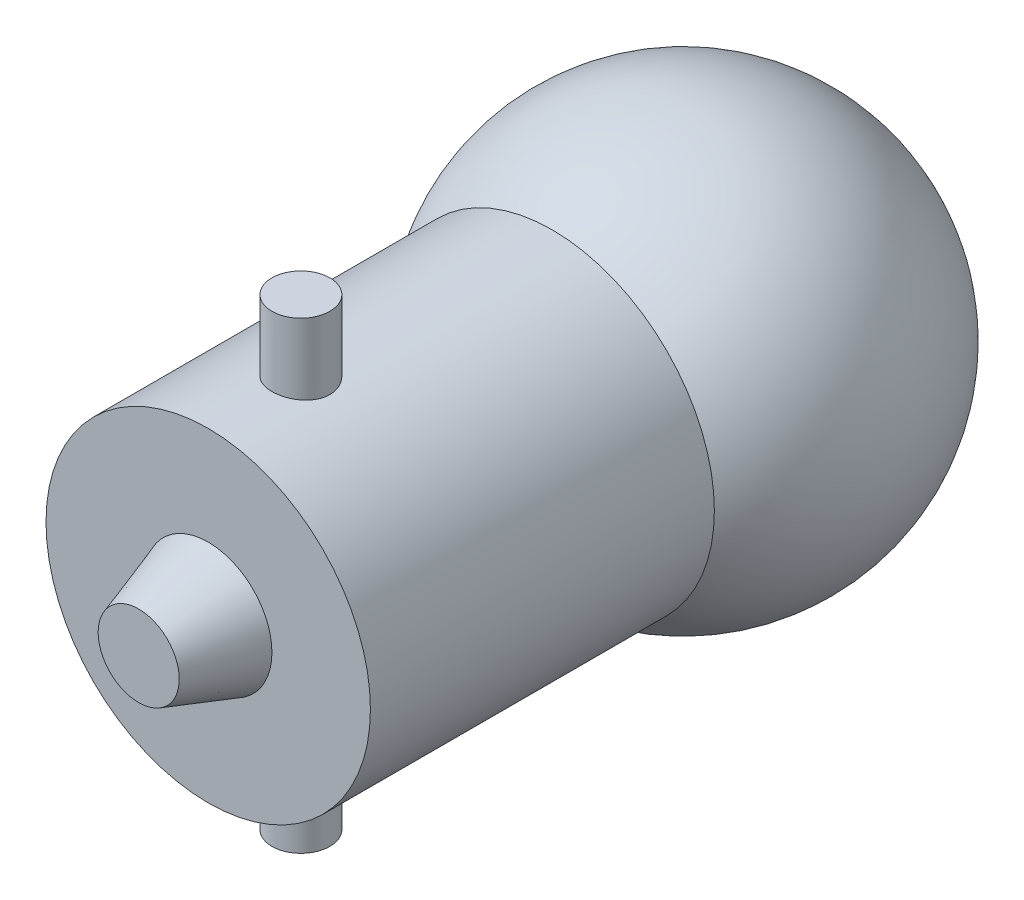
ISO-10303-21;
HEADER;
FILE_DESCRIPTION(('STEP AP214'),'2;1');
FILE_NAME('part.step','',(''),(''),'','','');
FILE_SCHEMA(('AUTOMOTIVE_DESIGN { 1 0 10303 214 1 1 1 1 }'));
ENDSEC;
DATA;
#1=APPLICATION_CONTEXT('core data for automotive mechanical design processes');
#2=APPLICATION_PROTOCOL_DEFINITION('international standard','automotive_design',2000,#1);
#3=PRODUCT_CONTEXT('',#1,'mechanical');
#4=PRODUCT('Part','Part','',(#3));
#5=PRODUCT_RELATED_PRODUCT_CATEGORY('part','',(#4));
#6=PRODUCT_DEFINITION_FORMATION('','',#4);
#7=PRODUCT_DEFINITION_CONTEXT('part definition',#1,'design');
#8=PRODUCT_DEFINITION('design','',#6,#7);
#9=PRODUCT_DEFINITION_SHAPE('','',#8);
#10=(LENGTH_UNIT() NAMED_UNIT(*) SI_UNIT(.MILLI.,.METRE.));
#11=(NAMED_UNIT(*) PLANE_ANGLE_UNIT() SI_UNIT($,.RADIAN.));
#12=(NAMED_UNIT(*) SI_UNIT($,.STERADIAN.) SOLID_ANGLE_UNIT());
#13=UNCERTAINTY_MEASURE_WITH_UNIT(LENGTH_MEASURE(1.E-05),#10,'distance_accuracy_value','');
#14=(GEOMETRIC_REPRESENTATION_CONTEXT(3) GLOBAL_UNCERTAINTY_ASSIGNED_CONTEXT((#13)) GLOBAL_UNIT_ASSIGNED_CONTEXT((#10,
#11,#12)) REPRESENTATION_CONTEXT('',''));
#15=CARTESIAN_POINT('',(0.,0.,0.));
#16=DIRECTION('',(0.,0.,1.));
#17=DIRECTION('',(1.,0.,0.));
#18=AXIS2_PLACEMENT_3D('',#15,#16,#17);
#19=CARTESIAN_POINT('',(0.,0.,15.));
#20=DIRECTION('',(0.,0.,-1.));
#21=DIRECTION('',(-1.,0.,0.));
#22=AXIS2_PLACEMENT_3D('',#19,#20,#21);
#23=CYLINDRICAL_SURFACE('',#22,7.);
#24=CARTESIAN_POINT('',(0.,-7.,9.75));
#25=CARTESIAN_POINT('',(0.0696197924423461,-6.99999876397597,9.75000272130107));
#26=CARTESIAN_POINT('',(0.139275699399384,-6.99895060928586,9.75583595122518));
#27=CARTESIAN_POINT('',(0.276628730775725,-6.99487029587918,9.77900208319115));
#28=CARTESIAN_POINT('',(0.344324082054933,-6.9918363963652,9.79634507541893));
#29=CARTESIAN_POINT('',(0.475749358001673,-6.98412437753366,9.84198611661902));
#30=CARTESIAN_POINT('',(0.539482660117311,-6.97944768188137,9.8702746821842));
#31=CARTESIAN_POINT('',(0.661291471994225,-6.96896231649392,9.93697784410853));
#32=CARTESIAN_POINT('',(0.719367522091878,-6.96315375502504,9.97539147209973));
#33=CARTESIAN_POINT('',(0.828853721624179,-6.95097616233974,10.0616996065088));
#34=CARTESIAN_POINT('',(0.880193210153492,-6.94460221026335,10.1096830649355));
#35=CARTESIAN_POINT('',(0.974138056636683,-6.93204924305886,10.2135773747688));
#36=CARTESIAN_POINT('',(1.01674282190199,-6.92587024118302,10.2694887636844));
#37=CARTESIAN_POINT('',(1.09229802264274,-6.914359051213,10.3881450585567));
#38=CARTESIAN_POINT('',(1.1251774596852,-6.90903321476433,10.450935843462));
#39=CARTESIAN_POINT('',(1.17989439084462,-6.89990026216799,10.5812605793323));
#40=CARTESIAN_POINT('',(1.20173274507262,-6.89609302772463,10.6487941603619));
#41=CARTESIAN_POINT('',(1.23352263528583,-6.89047765557561,10.7859344107074));
#42=CARTESIAN_POINT('',(1.24359686781956,-6.88864889795947,10.8555117775708));
#43=CARTESIAN_POINT('',(1.25195320297837,-6.88713528511934,10.9953914610037));
#44=CARTESIAN_POINT('',(1.25023626389775,-6.88745025566986,11.065693718196));
#45=CARTESIAN_POINT('',(1.23515868236774,-6.89016971388499,11.2041444487183));
#46=CARTESIAN_POINT('',(1.22193680797517,-6.8925492980011,11.2723085951271));
#47=CARTESIAN_POINT('',(1.18444287693055,-6.89909080824472,11.4054353182493));
#48=CARTESIAN_POINT('',(1.16017039053015,-6.90325280368823,11.4703977703427));
#49=CARTESIAN_POINT('',(1.1011263389819,-6.9129166031172,11.5956872394346));
#50=CARTESIAN_POINT('',(1.06629803938021,-6.91842561521352,11.6559869408044));
#51=CARTESIAN_POINT('',(0.987171201031504,-6.93015785316704,11.7699387511077));
#52=CARTESIAN_POINT('',(0.942871787902346,-6.93638114494264,11.8235902455496));
#53=CARTESIAN_POINT('',(0.845308544532937,-6.94894965501385,11.9235251088937));
#54=CARTESIAN_POINT('',(0.791925855758309,-6.95529534624387,11.9696924589898));
#55=CARTESIAN_POINT('',(0.678111000701383,-6.96731186800251,12.052433066454));
#56=CARTESIAN_POINT('',(0.61767877564558,-6.97298269290384,12.0890062438252));
#57=CARTESIAN_POINT('',(0.491364562705145,-6.98302041929516,12.1515345118481));
#58=CARTESIAN_POINT('',(0.425476883346251,-6.98738593655032,12.1774783411489));
#59=CARTESIAN_POINT('',(0.29018370051797,-6.99431030998523,12.217898441096));
#60=CARTESIAN_POINT('',(0.220778536182409,-6.99686933998133,12.2323758150364));
#61=CARTESIAN_POINT('',(0.081419492690855,-6.9998687531765,12.2492924230225));
#62=CARTESIAN_POINT('',(0.0114855085287156,-7.00033713461244,12.251890754274));
#63=CARTESIAN_POINT('',(-0.12781798113051,-6.99917952689596,12.2454011301183));
#64=CARTESIAN_POINT('',(-0.19718751154823,-6.99755363071634,12.2363136934861));
#65=CARTESIAN_POINT('',(-0.33289415494002,-6.99240754172808,12.2068428007549));
#66=CARTESIAN_POINT('',(-0.399249135096587,-6.98890072530253,12.1865390803911));
#67=CARTESIAN_POINT('',(-0.527613333347351,-6.98038436613849,12.1352976849073));
#68=CARTESIAN_POINT('',(-0.589622278004154,-6.97537472895227,12.1043593414156));
#69=CARTESIAN_POINT('',(-0.708218549757099,-6.96433866934137,12.0323693885438));
#70=CARTESIAN_POINT('',(-0.764745364265278,-6.95830256688857,11.9912196042301));
#71=CARTESIAN_POINT('',(-0.870148314945129,-6.94590984015708,11.9001086744692));
#72=CARTESIAN_POINT('',(-0.919023806795198,-6.93955318894435,11.8501467877033));
#73=CARTESIAN_POINT('',(-1.00833474628658,-6.92714394562996,11.7421125153762));
#74=CARTESIAN_POINT('',(-1.04866208560834,-6.92109590760897,11.6839501495664));
#75=CARTESIAN_POINT('',(-1.118974135387,-6.91007733322136,11.5615831552756));
#76=CARTESIAN_POINT('',(-1.14895920685207,-6.90510675924693,11.4973787377986));
#77=CARTESIAN_POINT('',(-1.19757853098714,-6.89684095181923,11.3650369125797));
#78=CARTESIAN_POINT('',(-1.21626421462318,-6.89353813880083,11.2969188945909));
#79=CARTESIAN_POINT('',(-1.24191447945726,-6.88896372120458,11.1584463524269));
#80=CARTESIAN_POINT('',(-1.24888024712932,-6.88769191101738,11.0880920553776));
#81=CARTESIAN_POINT('',(-1.25085614890263,-6.88733324217077,10.9482253955493));
#82=CARTESIAN_POINT('',(-1.24603664017667,-6.88821524963872,10.8787154614291));
#83=CARTESIAN_POINT('',(-1.22494973121549,-6.89199615523606,10.741513090991));
#84=CARTESIAN_POINT('',(-1.20868238480685,-6.89489504388228,10.6738206461289));
#85=CARTESIAN_POINT('',(-1.16523056932675,-6.90237052940211,10.5422550619833));
#86=CARTESIAN_POINT('',(-1.13806288257358,-6.9069445462846,10.478376224107));
#87=CARTESIAN_POINT('',(-1.07359967028368,-6.91725701322019,10.3560557802816));
#88=CARTESIAN_POINT('',(-1.03630352227252,-6.92299553483587,10.2976145088108));
#89=CARTESIAN_POINT('',(-0.952042837143915,-6.93508798882304,10.186971476305));
#90=CARTESIAN_POINT('',(-0.904953705777515,-6.94144922951402,10.1348653841284));
#91=CARTESIAN_POINT('',(-0.80270499863016,-6.95401412176594,10.0392370970169));
#92=CARTESIAN_POINT('',(-0.747543569019639,-6.9602177367425,9.99571687926136));
#93=CARTESIAN_POINT('',(-0.630185373301319,-6.9718267339403,9.91817111610558));
#94=CARTESIAN_POINT('',(-0.567935518835292,-6.97722528421424,9.88422487030421));
#95=CARTESIAN_POINT('',(-0.43854242009524,-6.98654935562555,9.82732539835363));
#96=CARTESIAN_POINT('',(-0.371403967978271,-6.99047629672906,9.8043615692512));
#97=CARTESIAN_POINT('',(-0.253365877745874,-6.99558898678742,9.77488469330196));
#98=CARTESIAN_POINT('',(-0.203167433835835,-6.99723399859315,9.76556843153164));
#99=CARTESIAN_POINT('',(-0.10198577601947,-6.99943994626216,9.75312515479814));
#100=CARTESIAN_POINT('',(-0.0510025790548308,-7.00000090549556,9.74999800640926));
#101=CARTESIAN_POINT('',(0.,-7.,9.75));
#102=B_SPLINE_CURVE_WITH_KNOTS('',3,(#24,#25,#26,#27,#28,#29,#30,#31,#32,#33,#34,#35,#36,#37,
#38,#39,#40,#41,#42,#43,#44,#45,#46,#47,#48,#49,#50,#51,#52,#53,#54,#55,#56,#57,#58,#59,#60,#61,
#62,#63,#64,#65,#66,#67,#68,#69,#70,#71,#72,#73,#74,#75,#76,#77,#78,#79,#80,#81,#82,#83,#84,#85,
#86,#87,#88,#89,#90,#91,#92,#93,#94,#95,#96,#97,#98,#99,#100,#101),.UNSPECIFIED.,.T.,.F.,(4,2,2,
2,2,2,2,2,2,2,2,2,2,2,2,2,2,2,2,2,2,2,2,2,2,2,2,2,2,2,2,2,2,2,2,2,2,2,4),(0.,0.208672898370815,
0.417528974687013,0.626204498745022,0.834860072169513,1.04555398394513,1.2562621874814,
1.46847268234669,1.68066664326101,1.89062713379412,2.10057056058128,2.30801629213301,
2.51547009175177,2.72405928697552,2.93266774767275,3.14425188945737,3.35583779539071,
3.56764729168083,3.77943640533442,3.98838053310807,4.1973153853916,4.40478370072621,
4.61226505754755,4.82182420244065,5.03140098492948,5.24348810388942,5.45556781896717,
5.66667480743361,5.87776042304788,6.08581286176575,6.29386432224868,6.50159668543025,
6.70934181830654,6.91991234386763,7.13053130374627,7.34284672270063,7.5549567462605,
7.70783116702345,7.8607022920641),.UNSPECIFIED.);
#103=CARTESIAN_POINT('',(0.,-7.,9.75));
#104=VERTEX_POINT('',#103);
#105=EDGE_CURVE('E42',#104,#104,#102,.T.);
#106=ORIENTED_EDGE('',*,*,#105,.F.);
#107=EDGE_LOOP('',(#106));
#108=FACE_BOUND('',#107,.T.);
#109=CARTESIAN_POINT('',(0.,0.,15.));
#110=DIRECTION('',(0.,0.,1.));
#111=DIRECTION('',(1.,0.,0.));
#112=AXIS2_PLACEMENT_3D('',#109,#110,#111);
#113=CIRCLE('',#112,7.);
#114=CARTESIAN_POINT('',(7.,0.,15.));
#115=VERTEX_POINT('',#114);
#116=EDGE_CURVE('E78',#115,#115,#113,.T.);
#117=ORIENTED_EDGE('',*,*,#116,.F.);
#118=EDGE_LOOP('',(#117));
#119=FACE_BOUND('',#118,.T.);
#120=CARTESIAN_POINT('',(0.,0.,0.156854249492379));
#121=DIRECTION('',(0.,0.,-1.));
#122=DIRECTION('',(-1.,0.,0.));
#123=AXIS2_PLACEMENT_3D('',#120,#121,#122);
#124=CIRCLE('',#123,7.);
#125=CARTESIAN_POINT('',(-7.,0.,0.156854249492379));
#126=VERTEX_POINT('',#125);
#127=EDGE_CURVE('E46',#126,#126,#124,.T.);
#128=ORIENTED_EDGE('',*,*,#127,.F.);
#129=EDGE_LOOP('',(#128));
#130=FACE_BOUND('',#129,.T.);
#131=CARTESIAN_POINT('',(0.,7.,9.75));
#132=CARTESIAN_POINT('',(-0.0696197924423461,6.99999876397597,9.75000272130107));
#133=CARTESIAN_POINT('',(-0.139275699399384,6.99895060928586,9.75583595122518));
#134=CARTESIAN_POINT('',(-0.276628730775725,6.99487029587918,9.77900208319115));
#135=CARTESIAN_POINT('',(-0.344324082054933,6.9918363963652,9.79634507541893));
#136=CARTESIAN_POINT('',(-0.475749358001673,6.98412437753366,9.84198611661902));
#137=CARTESIAN_POINT('',(-0.539482660117311,6.97944768188137,9.8702746821842));
#138=CARTESIAN_POINT('',(-0.661291471994225,6.96896231649392,9.93697784410853));
#139=CARTESIAN_POINT('',(-0.719367522091878,6.96315375502504,9.97539147209973));
#140=CARTESIAN_POINT('',(-0.828853721624179,6.95097616233974,10.0616996065088));
#141=CARTESIAN_POINT('',(-0.880193210153492,6.94460221026335,10.1096830649355));
#142=CARTESIAN_POINT('',(-0.974138056636683,6.93204924305886,10.2135773747688));
#143=CARTESIAN_POINT('',(-1.01674282190199,6.92587024118302,10.2694887636844));
#144=CARTESIAN_POINT('',(-1.09229802264274,6.914359051213,10.3881450585567));
#145=CARTESIAN_POINT('',(-1.1251774596852,6.90903321476433,10.450935843462));
#146=CARTESIAN_POINT('',(-1.17989439084462,6.89990026216799,10.5812605793323));
#147=CARTESIAN_POINT('',(-1.20173274507262,6.89609302772463,10.6487941603619));
#148=CARTESIAN_POINT('',(-1.23352263528583,6.89047765557561,10.7859344107074));
#149=CARTESIAN_POINT('',(-1.24359686781956,6.88864889795947,10.8555117775708));
#150=CARTESIAN_POINT('',(-1.25195320297837,6.88713528511934,10.9953914610037));
#151=CARTESIAN_POINT('',(-1.25023626389775,6.88745025566986,11.065693718196));
#152=CARTESIAN_POINT('',(-1.23515868236774,6.89016971388499,11.2041444487183));
#153=CARTESIAN_POINT('',(-1.22193680797517,6.8925492980011,11.2723085951271));
#154=CARTESIAN_POINT('',(-1.18444287693055,6.89909080824472,11.4054353182493));
#155=CARTESIAN_POINT('',(-1.16017039053015,6.90325280368823,11.4703977703427));
#156=CARTESIAN_POINT('',(-1.1011263389819,6.9129166031172,11.5956872394346));
#157=CARTESIAN_POINT('',(-1.06629803938021,6.91842561521352,11.6559869408044));
#158=CARTESIAN_POINT('',(-0.987171201031504,6.93015785316704,11.7699387511077));
#159=CARTESIAN_POINT('',(-0.942871787902346,6.93638114494264,11.8235902455496));
#160=CARTESIAN_POINT('',(-0.845308544532937,6.94894965501385,11.9235251088937));
#161=CARTESIAN_POINT('',(-0.791925855758309,6.95529534624387,11.9696924589898));
#162=CARTESIAN_POINT('',(-0.678111000701383,6.96731186800251,12.052433066454));
#163=CARTESIAN_POINT('',(-0.61767877564558,6.97298269290384,12.0890062438252));
#164=CARTESIAN_POINT('',(-0.491364562705145,6.98302041929516,12.1515345118481));
#165=CARTESIAN_POINT('',(-0.425476883346251,6.98738593655032,12.1774783411489));
#166=CARTESIAN_POINT('',(-0.29018370051797,6.99431030998523,12.217898441096));
#167=CARTESIAN_POINT('',(-0.220778536182409,6.99686933998133,12.2323758150364));
#168=CARTESIAN_POINT('',(-0.081419492690855,6.9998687531765,12.2492924230225));
#169=CARTESIAN_POINT('',(-0.0114855085287156,7.00033713461244,12.251890754274));
#170=CARTESIAN_POINT('',(0.12781798113051,6.99917952689596,12.2454011301183));
#171=CARTESIAN_POINT('',(0.19718751154823,6.99755363071634,12.2363136934861));
#172=CARTESIAN_POINT('',(0.33289415494002,6.99240754172808,12.2068428007549));
#173=CARTESIAN_POINT('',(0.399249135096587,6.98890072530253,12.1865390803911));
#174=CARTESIAN_POINT('',(0.527613333347351,6.98038436613849,12.1352976849073));
#175=CARTESIAN_POINT('',(0.589622278004154,6.97537472895227,12.1043593414156));
#176=CARTESIAN_POINT('',(0.708218549757099,6.96433866934137,12.0323693885438));
#177=CARTESIAN_POINT('',(0.764745364265278,6.95830256688857,11.9912196042301));
#178=CARTESIAN_POINT('',(0.870148314945129,6.94590984015708,11.9001086744692));
#179=CARTESIAN_POINT('',(0.919023806795198,6.93955318894435,11.8501467877033));
#180=CARTESIAN_POINT('',(1.00833474628658,6.92714394562996,11.7421125153762));
#181=CARTESIAN_POINT('',(1.04866208560834,6.92109590760897,11.6839501495664));
#182=CARTESIAN_POINT('',(1.118974135387,6.91007733322136,11.5615831552756));
#183=CARTESIAN_POINT('',(1.14895920685207,6.90510675924693,11.4973787377986));
#184=CARTESIAN_POINT('',(1.19757853098714,6.89684095181923,11.3650369125797));
#185=CARTESIAN_POINT('',(1.21626421462318,6.89353813880083,11.2969188945909));
#186=CARTESIAN_POINT('',(1.24191447945726,6.88896372120458,11.1584463524269));
#187=CARTESIAN_POINT('',(1.24888024712932,6.88769191101738,11.0880920553776));
#188=CARTESIAN_POINT('',(1.25085614890263,6.88733324217077,10.9482253955493));
#189=CARTESIAN_POINT('',(1.24603664017667,6.88821524963872,10.8787154614291));
#190=CARTESIAN_POINT('',(1.22494973121549,6.89199615523606,10.741513090991));
#191=CARTESIAN_POINT('',(1.20868238480685,6.89489504388228,10.6738206461289));
#192=CARTESIAN_POINT('',(1.16523056932675,6.90237052940211,10.5422550619833));
#193=CARTESIAN_POINT('',(1.13806288257358,6.9069445462846,10.478376224107));
#194=CARTESIAN_POINT('',(1.07359967028368,6.91725701322019,10.3560557802816));
#195=CARTESIAN_POINT('',(1.03630352227252,6.92299553483587,10.2976145088108));
#196=CARTESIAN_POINT('',(0.952042837143915,6.93508798882304,10.186971476305));
#197=CARTESIAN_POINT('',(0.904953705777515,6.94144922951402,10.1348653841284));
#198=CARTESIAN_POINT('',(0.80270499863016,6.95401412176594,10.0392370970169));
#199=CARTESIAN_POINT('',(0.747543569019639,6.9602177367425,9.99571687926136));
#200=CARTESIAN_POINT('',(0.630185373301319,6.9718267339403,9.91817111610558));
#201=CARTESIAN_POINT('',(0.567935518835292,6.97722528421424,9.88422487030421));
#202=CARTESIAN_POINT('',(0.43854242009524,6.98654935562555,9.82732539835363));
#203=CARTESIAN_POINT('',(0.371403967978271,6.99047629672906,9.8043615692512));
#204=CARTESIAN_POINT('',(0.253365877745874,6.99558898678742,9.77488469330196));
#205=CARTESIAN_POINT('',(0.203167433835835,6.99723399859315,9.76556843153164));
#206=CARTESIAN_POINT('',(0.10198577601947,6.99943994626216,9.75312515479814));
#207=CARTESIAN_POINT('',(0.0510025790548308,7.00000090549556,9.74999800640926));
#208=CARTESIAN_POINT('',(0.,7.,9.75));
#209=B_SPLINE_CURVE_WITH_KNOTS('',3,(#131,#132,#133,#134,#135,#136,#137,#138,#139,#140,#141,
#142,#143,#144,#145,#146,#147,#148,#149,#150,#151,#152,#153,#154,#155,#156,#157,#158,#159,#160,
#161,#162,#163,#164,#165,#166,#167,#168,#169,#170,#171,#172,#173,#174,#175,#176,#177,#178,#179,
#180,#181,#182,#183,#184,#185,#186,#187,#188,#189,#190,#191,#192,#193,#194,#195,#196,#197,#198,
#199,#200,#201,#202,#203,#204,#205,#206,#207,#208),.UNSPECIFIED.,.T.,.F.,(4,2,2,2,2,2,2,2,2,2,2,
2,2,2,2,2,2,2,2,2,2,2,2,2,2,2,2,2,2,2,2,2,2,2,2,2,2,2,4),(0.,0.208672898370815,
0.417528974687013,0.626204498745022,0.834860072169513,1.04555398394513,1.2562621874814,
1.46847268234669,1.68066664326101,1.89062713379412,2.10057056058128,2.30801629213301,
2.51547009175177,2.72405928697552,2.93266774767275,3.14425188945737,3.35583779539071,
3.56764729168083,3.77943640533442,3.98838053310807,4.1973153853916,4.40478370072621,
4.61226505754755,4.82182420244065,5.03140098492948,5.24348810388942,5.45556781896717,
5.66667480743361,5.87776042304788,6.08581286176575,6.29386432224868,6.50159668543025,
6.70934181830654,6.91991234386763,7.13053130374627,7.34284672270063,7.5549567462605,
7.70783116702345,7.8607022920641),.UNSPECIFIED.);
#210=CARTESIAN_POINT('',(0.,7.,9.75));
#211=VERTEX_POINT('',#210);
#212=EDGE_CURVE('E38',#211,#211,#209,.T.);
#213=ORIENTED_EDGE('',*,*,#212,.F.);
#214=EDGE_LOOP('',(#213));
#215=FACE_BOUND('',#214,.T.);
#216=ADVANCED_FACE('F31',(#108,#119,#130,#215),#23,.T.);
#217=CARTESIAN_POINT('',(0.,0.,15.));
#218=DIRECTION('',(0.,0.,1.));
#219=DIRECTION('',(1.,0.,0.));
#220=AXIS2_PLACEMENT_3D('',#217,#218,#219);
#221=PLANE('',#220);
#222=CARTESIAN_POINT('',(0.,0.,15.));
#223=DIRECTION('',(0.,0.,1.));
#224=DIRECTION('',(1.,0.,0.));
#225=AXIS2_PLACEMENT_3D('',#222,#223,#224);
#226=CIRCLE('',#225,2.75);
#227=CARTESIAN_POINT('',(2.75,0.,15.));
#228=VERTEX_POINT('',#227);
#229=EDGE_CURVE('E10',#228,#228,#226,.T.);
#230=ORIENTED_EDGE('',*,*,#229,.F.);
#231=EDGE_LOOP('',(#230));
#232=FACE_BOUND('',#231,.T.);
#233=ORIENTED_EDGE('',*,*,#116,.T.);
#234=EDGE_LOOP('',(#233));
#235=FACE_BOUND('',#234,.T.);
#236=ADVANCED_FACE('F67',(#232,#235),#221,.T.);
#237=CARTESIAN_POINT('',(0.,0.,-5.5));
#238=DIRECTION('',(0.,1.,0.));
#239=DIRECTION('',(0.,0.,-1.));
#240=AXIS2_PLACEMENT_3D('',#237,#238,#239);
#241=SPHERICAL_SURFACE('',#240,9.);
#242=CARTESIAN_POINT('',(0.,0.,-5.5));
#243=DIRECTION('',(0.,0.,-1.));
#244=DIRECTION('',(-1.,0.,0.));
#245=AXIS2_PLACEMENT_3D('',#242,#243,#244);
#246=SPHERICAL_SURFACE('',#245,9.);
#247=ORIENTED_EDGE('',*,*,#127,.T.);
#248=EDGE_LOOP('',(#247));
#249=FACE_BOUND('',#248,.T.);
#250=ADVANCED_FACE('F63',(#249),#246,.T.);
#251=CARTESIAN_POINT('',(0.,-10.,11.));
#252=DIRECTION('',(0.,1.,0.));
#253=DIRECTION('',(0.,0.,1.));
#254=AXIS2_PLACEMENT_3D('',#251,#252,#253);
#255=PLANE('',#254);
#256=CARTESIAN_POINT('',(0.,-10.,11.));
#257=DIRECTION('',(0.,1.,0.));
#258=DIRECTION('',(0.,0.,1.));
#259=AXIS2_PLACEMENT_3D('',#256,#257,#258);
#260=CIRCLE('',#259,1.25);
#261=CARTESIAN_POINT('',(0.,-10.,12.25));
#262=VERTEX_POINT('',#261);
#263=EDGE_CURVE('E84',#262,#262,#260,.T.);
#264=ORIENTED_EDGE('',*,*,#263,.F.);
#265=EDGE_LOOP('',(#264));
#266=FACE_BOUND('',#265,.T.);
#267=ADVANCED_FACE('F66',(#266),#255,.F.);
#268=CARTESIAN_POINT('',(0.,10.,11.));
#269=DIRECTION('',(0.,-1.,0.));
#270=DIRECTION('',(0.,0.,-1.));
#271=AXIS2_PLACEMENT_3D('',#268,#269,#270);
#272=CYLINDRICAL_SURFACE('',#271,1.25);
#273=ORIENTED_EDGE('',*,*,#263,.T.);
#274=EDGE_LOOP('',(#273));
#275=FACE_BOUND('',#274,.T.);
#276=ORIENTED_EDGE('',*,*,#105,.T.);
#277=EDGE_LOOP('',(#276));
#278=FACE_BOUND('',#277,.T.);
#279=ADVANCED_FACE('F60',(#275,#278),#272,.T.);
#280=CARTESIAN_POINT('',(0.,10.,11.));
#281=DIRECTION('',(0.,1.,0.));
#282=DIRECTION('',(0.,0.,1.));
#283=AXIS2_PLACEMENT_3D('',#280,#281,#282);
#284=CIRCLE('',#283,1.25);
#285=CARTESIAN_POINT('',(0.,10.,12.25));
#286=VERTEX_POINT('',#285);
#287=EDGE_CURVE('E80',#286,#286,#284,.T.);
#288=ORIENTED_EDGE('',*,*,#287,.F.);
#289=EDGE_LOOP('',(#288));
#290=FACE_BOUND('',#289,.T.);
#291=ORIENTED_EDGE('',*,*,#212,.T.);
#292=EDGE_LOOP('',(#291));
#293=FACE_BOUND('',#292,.T.);
#294=ADVANCED_FACE('F54',(#290,#293),#272,.T.);
#295=CARTESIAN_POINT('',(0.,10.,11.));
#296=DIRECTION('',(0.,1.,0.));
#297=DIRECTION('',(0.,0.,1.));
#298=AXIS2_PLACEMENT_3D('',#295,#296,#297);
#299=PLANE('',#298);
#300=ORIENTED_EDGE('',*,*,#287,.T.);
#301=EDGE_LOOP('',(#300));
#302=FACE_BOUND('',#301,.T.);
#303=ADVANCED_FACE('F59',(#302),#299,.T.);
#304=CARTESIAN_POINT('',(0.,0.,18.));
#305=DIRECTION('',(0.,0.,1.));
#306=DIRECTION('',(1.,0.,0.));
#307=AXIS2_PLACEMENT_3D('',#304,#305,#306);
#308=PLANE('',#307);
#309=CARTESIAN_POINT('',(0.,0.,18.));
#310=DIRECTION('',(0.,0.,-1.));
#311=DIRECTION('',(-1.,0.,0.));
#312=AXIS2_PLACEMENT_3D('',#309,#310,#311);
#313=CIRCLE('',#312,1.75);
#314=CARTESIAN_POINT('',(-1.75,0.,18.));
#315=VERTEX_POINT('',#314);
#316=EDGE_CURVE('E89',#315,#315,#313,.T.);
#317=ORIENTED_EDGE('',*,*,#316,.F.);
#318=EDGE_LOOP('',(#317));
#319=FACE_BOUND('',#318,.T.);
#320=ADVANCED_FACE('F95',(#319),#308,.T.);
#321=CARTESIAN_POINT('',(0.,0.,15.));
#322=DIRECTION('',(0.,0.,-1.));
#323=DIRECTION('',(-1.,0.,0.));
#324=AXIS2_PLACEMENT_3D('',#321,#322,#323);
#325=CONICAL_SURFACE('',#324,2.75,0.321750554396642);
#326=ORIENTED_EDGE('',*,*,#316,.T.);
#327=EDGE_LOOP('',(#326));
#328=FACE_BOUND('',#327,.T.);
#329=ORIENTED_EDGE('',*,*,#229,.T.);
#330=EDGE_LOOP('',(#329));
#331=FACE_BOUND('',#330,.T.);
#332=ADVANCED_FACE('F93',(#328,#331),#325,.T.);
#333=CLOSED_SHELL('',(#216,#236,#250,#267,#279,#294,#303,#320,#332));
#334=MANIFOLD_SOLID_BREP('B2',#333);
#335=ADVANCED_BREP_SHAPE_REPRESENTATION('',(#18,#334),#14);
#336=SHAPE_DEFINITION_REPRESENTATION(#9,#335);
ENDSEC;
END-ISO-10303-21;
